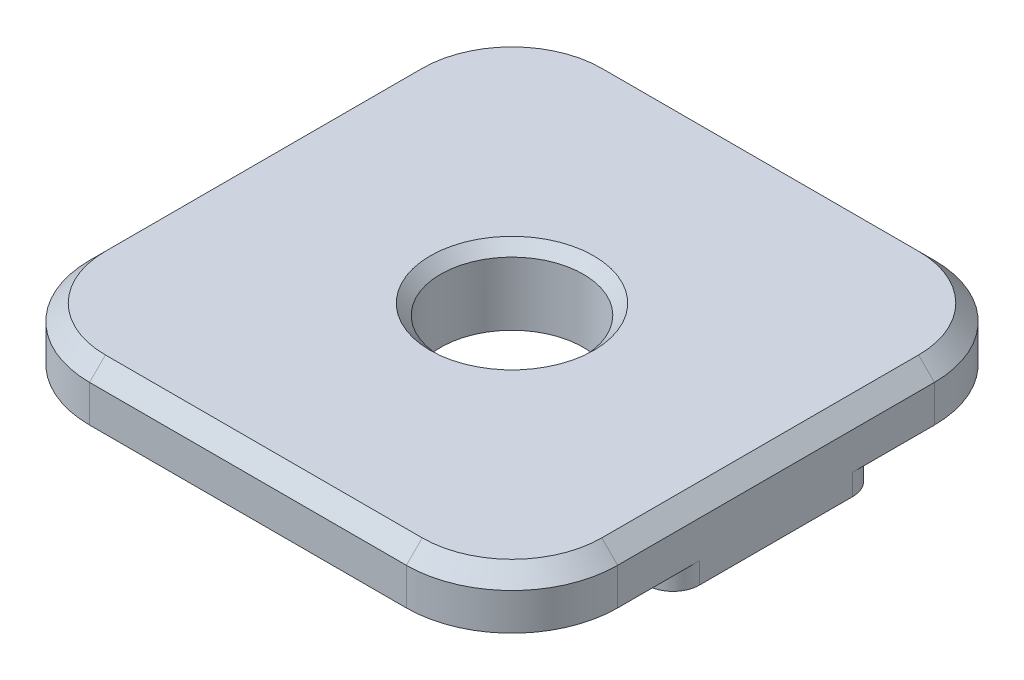
ISO-10303-21;
HEADER;
FILE_DESCRIPTION(('STEP AP214'),'2;1');
FILE_NAME('part.step','',(''),(''),'','','');
FILE_SCHEMA(('AUTOMOTIVE_DESIGN { 1 0 10303 214 1 1 1 1 }'));
ENDSEC;
DATA;
#1=APPLICATION_CONTEXT('core data for automotive mechanical design processes');
#2=APPLICATION_PROTOCOL_DEFINITION('international standard','automotive_design',2000,#1);
#3=PRODUCT_CONTEXT('',#1,'mechanical');
#4=PRODUCT('Part','Part','',(#3));
#5=PRODUCT_RELATED_PRODUCT_CATEGORY('part','',(#4));
#6=PRODUCT_DEFINITION_FORMATION('','',#4);
#7=PRODUCT_DEFINITION_CONTEXT('part definition',#1,'design');
#8=PRODUCT_DEFINITION('design','',#6,#7);
#9=PRODUCT_DEFINITION_SHAPE('','',#8);
#10=(LENGTH_UNIT() NAMED_UNIT(*) SI_UNIT(.MILLI.,.METRE.));
#11=(NAMED_UNIT(*) PLANE_ANGLE_UNIT() SI_UNIT($,.RADIAN.));
#12=(NAMED_UNIT(*) SI_UNIT($,.STERADIAN.) SOLID_ANGLE_UNIT());
#13=UNCERTAINTY_MEASURE_WITH_UNIT(LENGTH_MEASURE(1.E-05),#10,'distance_accuracy_value','');
#14=(GEOMETRIC_REPRESENTATION_CONTEXT(3) GLOBAL_UNCERTAINTY_ASSIGNED_CONTEXT((#13)) GLOBAL_UNIT_ASSIGNED_CONTEXT((#10,
#11,#12)) REPRESENTATION_CONTEXT('',''));
#15=CARTESIAN_POINT('',(0.,0.,0.));
#16=DIRECTION('',(0.,0.,1.));
#17=DIRECTION('',(1.,0.,0.));
#18=AXIS2_PLACEMENT_3D('',#15,#16,#17);
#19=CARTESIAN_POINT('',(-141.999999999975,24.9999599456627,478.900000000001));
#20=DIRECTION('',(0.,0.,1.));
#21=DIRECTION('',(1.,0.,0.));
#22=AXIS2_PLACEMENT_3D('',#19,#20,#21);
#23=PLANE('',#22);
#24=DIRECTION('',(0.,-1.,0.));
#25=VECTOR('',#24,1.);
#26=CARTESIAN_POINT('',(-160.999999999975,24.9999599456629,478.900000000001));
#27=LINE('',#26,#25);
#28=CARTESIAN_POINT('',(-160.999999999975,24.1999599456627,478.900000000001));
#29=VERTEX_POINT('',#28);
#30=CARTESIAN_POINT('',(-160.999999999975,24.9999599456627,478.900000000001));
#31=VERTEX_POINT('',#30);
#32=EDGE_CURVE('E132',#29,#31,#27,.F.);
#33=ORIENTED_EDGE('',*,*,#32,.F.);
#34=DIRECTION('',(1.,0.,0.));
#35=VECTOR('',#34,1.);
#36=CARTESIAN_POINT('',(-151.999999999975,24.1999599456627,478.900000000001));
#37=LINE('',#36,#35);
#38=CARTESIAN_POINT('',(-142.999999999975,24.1999599456627,478.900000000001));
#39=VERTEX_POINT('',#38);
#40=EDGE_CURVE('E219',#39,#29,#37,.F.);
#41=ORIENTED_EDGE('',*,*,#40,.F.);
#42=DIRECTION('',(0.,-1.,0.));
#43=VECTOR('',#42,1.);
#44=CARTESIAN_POINT('',(-142.999999999975,24.9999599456626,478.900000000001));
#45=LINE('',#44,#43);
#46=CARTESIAN_POINT('',(-142.999999999975,24.9999599456627,478.900000000001));
#47=VERTEX_POINT('',#46);
#48=EDGE_CURVE('E146',#47,#39,#45,.T.);
#49=ORIENTED_EDGE('',*,*,#48,.F.);
#50=DIRECTION('',(1.,0.,0.));
#51=VECTOR('',#50,1.);
#52=CARTESIAN_POINT('',(-5.82645044580608E-12,24.9999599456627,478.900000000001));
#53=LINE('',#52,#51);
#54=EDGE_CURVE('E145',#47,#31,#53,.F.);
#55=ORIENTED_EDGE('',*,*,#54,.T.);
#56=EDGE_LOOP('',(#33,#41,#49,#55));
#57=FACE_BOUND('',#56,.T.);
#58=ADVANCED_FACE('F17',(#57),#23,.T.);
#59=CARTESIAN_POINT('',(-161.999999999975,24.9999599456629,471.100000000001));
#60=DIRECTION('',(0.,0.,-1.));
#61=DIRECTION('',(-1.,0.,0.));
#62=AXIS2_PLACEMENT_3D('',#59,#60,#61);
#63=PLANE('',#62);
#64=DIRECTION('',(0.,-1.,0.));
#65=VECTOR('',#64,1.);
#66=CARTESIAN_POINT('',(-160.999999999975,24.999959945663,471.100000000001));
#67=LINE('',#66,#65);
#68=CARTESIAN_POINT('',(-160.999999999975,24.9999599456629,471.100000000001));
#69=VERTEX_POINT('',#68);
#70=CARTESIAN_POINT('',(-160.999999999975,24.1999599456629,471.100000000001));
#71=VERTEX_POINT('',#70);
#72=EDGE_CURVE('E142',#69,#71,#67,.T.);
#73=ORIENTED_EDGE('',*,*,#72,.F.);
#74=DIRECTION('',(1.,0.,0.));
#75=VECTOR('',#74,1.);
#76=CARTESIAN_POINT('',(-5.82645044580608E-12,24.9999599456629,471.100000000001));
#77=LINE('',#76,#75);
#78=CARTESIAN_POINT('',(-142.999999999975,24.9999599456629,471.100000000001));
#79=VERTEX_POINT('',#78);
#80=EDGE_CURVE('E225',#69,#79,#77,.T.);
#81=ORIENTED_EDGE('',*,*,#80,.T.);
#82=DIRECTION('',(0.,-1.,0.));
#83=VECTOR('',#82,1.);
#84=CARTESIAN_POINT('',(-142.999999999975,24.9999599456627,471.100000000001));
#85=LINE('',#84,#83);
#86=CARTESIAN_POINT('',(-142.999999999975,24.1999599456629,471.100000000001));
#87=VERTEX_POINT('',#86);
#88=EDGE_CURVE('E177',#87,#79,#85,.F.);
#89=ORIENTED_EDGE('',*,*,#88,.F.);
#90=DIRECTION('',(1.,0.,0.));
#91=VECTOR('',#90,1.);
#92=CARTESIAN_POINT('',(-151.999999999975,24.1999599456629,471.100000000001));
#93=LINE('',#92,#91);
#94=EDGE_CURVE('E217',#71,#87,#93,.T.);
#95=ORIENTED_EDGE('',*,*,#94,.F.);
#96=EDGE_LOOP('',(#73,#81,#89,#95));
#97=FACE_BOUND('',#96,.T.);
#98=ADVANCED_FACE('F644',(#97),#63,.T.);
#99=CARTESIAN_POINT('',(-160.999999999975,24.999959945663,472.100000000001));
#100=DIRECTION('',(0.,-1.,0.));
#101=DIRECTION('',(1.,0.,0.));
#102=AXIS2_PLACEMENT_3D('',#99,#100,#101);
#103=CYLINDRICAL_SURFACE('',#102,1.);
#104=CARTESIAN_POINT('',(-160.999999999975,24.9999599456629,472.100000000001));
#105=DIRECTION('',(0.,-1.,0.));
#106=DIRECTION('',(1.,0.,0.));
#107=AXIS2_PLACEMENT_3D('',#104,#105,#106);
#108=CIRCLE('',#107,1.);
#109=CARTESIAN_POINT('',(-161.999999999975,24.999959945663,472.100000000001));
#110=VERTEX_POINT('',#109);
#111=EDGE_CURVE('E226',#110,#69,#108,.T.);
#112=ORIENTED_EDGE('',*,*,#111,.T.);
#113=ORIENTED_EDGE('',*,*,#72,.T.);
#114=CARTESIAN_POINT('',(-160.999999999975,24.1999599456629,472.100000000001));
#115=DIRECTION('',(0.,-1.,0.));
#116=DIRECTION('',(1.,0.,0.));
#117=AXIS2_PLACEMENT_3D('',#114,#115,#116);
#118=CIRCLE('',#117,1.);
#119=CARTESIAN_POINT('',(-161.999999999975,24.1999599456629,472.100000000001));
#120=VERTEX_POINT('',#119);
#121=EDGE_CURVE('E214',#120,#71,#118,.T.);
#122=ORIENTED_EDGE('',*,*,#121,.F.);
#123=DIRECTION('',(0.,1.,0.));
#124=VECTOR('',#123,1.);
#125=CARTESIAN_POINT('',(-161.999999999975,24.9999599456631,472.100000000001));
#126=LINE('',#125,#124);
#127=EDGE_CURVE('E169',#110,#120,#126,.F.);
#128=ORIENTED_EDGE('',*,*,#127,.F.);
#129=EDGE_LOOP('',(#112,#113,#122,#128));
#130=FACE_BOUND('',#129,.T.);
#131=ADVANCED_FACE('F636',(#130),#103,.T.);
#132=CARTESIAN_POINT('',(-160.999999999975,24.9999599456629,477.900000000001));
#133=DIRECTION('',(0.,-1.,0.));
#134=DIRECTION('',(1.,0.,0.));
#135=AXIS2_PLACEMENT_3D('',#132,#133,#134);
#136=CYLINDRICAL_SURFACE('',#135,1.);
#137=CARTESIAN_POINT('',(-160.999999999975,24.9999599456627,477.900000000001));
#138=DIRECTION('',(0.,-1.,0.));
#139=DIRECTION('',(1.,0.,0.));
#140=AXIS2_PLACEMENT_3D('',#137,#138,#139);
#141=CIRCLE('',#140,1.);
#142=CARTESIAN_POINT('',(-161.999999999975,24.9999599456627,477.900000000001));
#143=VERTEX_POINT('',#142);
#144=EDGE_CURVE('E20',#31,#143,#141,.T.);
#145=ORIENTED_EDGE('',*,*,#144,.T.);
#146=DIRECTION('',(0.,1.,0.));
#147=VECTOR('',#146,1.);
#148=CARTESIAN_POINT('',(-161.999999999975,24.9999599456631,477.900000000001));
#149=LINE('',#148,#147);
#150=CARTESIAN_POINT('',(-161.999999999975,24.1999599456628,477.900000000001));
#151=VERTEX_POINT('',#150);
#152=EDGE_CURVE('E161',#151,#143,#149,.T.);
#153=ORIENTED_EDGE('',*,*,#152,.F.);
#154=CARTESIAN_POINT('',(-160.999999999975,24.1999599456627,477.900000000001));
#155=DIRECTION('',(0.,-1.,0.));
#156=DIRECTION('',(1.,0.,0.));
#157=AXIS2_PLACEMENT_3D('',#154,#155,#156);
#158=CIRCLE('',#157,1.);
#159=EDGE_CURVE('E138',#29,#151,#158,.T.);
#160=ORIENTED_EDGE('',*,*,#159,.F.);
#161=ORIENTED_EDGE('',*,*,#32,.T.);
#162=EDGE_LOOP('',(#145,#153,#160,#161));
#163=FACE_BOUND('',#162,.T.);
#164=ADVANCED_FACE('F134',(#163),#136,.T.);
#165=CARTESIAN_POINT('',(-5.82645044580608E-12,24.9999599456628,475.000000476843));
#166=DIRECTION('',(0.,1.,0.));
#167=DIRECTION('',(0.,0.,1.));
#168=AXIS2_PLACEMENT_3D('',#165,#166,#167);
#169=PLANE('',#168);
#170=CARTESIAN_POINT('',(-142.999999999975,24.9999599456627,477.900000000001));
#171=DIRECTION('',(0.,-1.,0.));
#172=DIRECTION('',(1.,0.,0.));
#173=AXIS2_PLACEMENT_3D('',#170,#171,#172);
#174=CIRCLE('',#173,1.);
#175=CARTESIAN_POINT('',(-141.999999999975,24.9999599456626,477.900000000001));
#176=VERTEX_POINT('',#175);
#177=EDGE_CURVE('E149',#176,#47,#174,.T.);
#178=ORIENTED_EDGE('',*,*,#177,.F.);
#179=DIRECTION('',(0.,0.,-1.));
#180=VECTOR('',#179,1.);
#181=CARTESIAN_POINT('',(-141.999999999975,24.9999599456626,485.000000000001));
#182=LINE('',#181,#180);
#183=CARTESIAN_POINT('',(-141.999999999975,24.9999599456626,481.000000000001));
#184=VERTEX_POINT('',#183);
#185=EDGE_CURVE('E237',#184,#176,#182,.T.);
#186=ORIENTED_EDGE('',*,*,#185,.F.);
#187=CARTESIAN_POINT('',(-145.999999999975,24.9999599456626,481.000000000001));
#188=DIRECTION('',(0.,1.,0.));
#189=DIRECTION('',(0.,0.,1.));
#190=AXIS2_PLACEMENT_3D('',#187,#188,#189);
#191=CIRCLE('',#190,4.);
#192=CARTESIAN_POINT('',(-145.999999999975,24.9999599456625,485.000000000001));
#193=VERTEX_POINT('',#192);
#194=EDGE_CURVE('E208',#193,#184,#191,.T.);
#195=ORIENTED_EDGE('',*,*,#194,.F.);
#196=DIRECTION('',(1.,0.,0.));
#197=VECTOR('',#196,1.);
#198=CARTESIAN_POINT('',(-161.999999999975,24.9999599456625,485.000000000001));
#199=LINE('',#198,#197);
#200=CARTESIAN_POINT('',(-157.999999999975,24.9999599456625,485.000000000001));
#201=VERTEX_POINT('',#200);
#202=EDGE_CURVE('E267',#201,#193,#199,.T.);
#203=ORIENTED_EDGE('',*,*,#202,.F.);
#204=CARTESIAN_POINT('',(-157.999999999975,24.9999599456626,481.000000000001));
#205=DIRECTION('',(0.,1.,0.));
#206=DIRECTION('',(0.,0.,1.));
#207=AXIS2_PLACEMENT_3D('',#204,#205,#206);
#208=CIRCLE('',#207,4.);
#209=CARTESIAN_POINT('',(-161.999999999975,24.9999599456626,481.000000000001));
#210=VERTEX_POINT('',#209);
#211=EDGE_CURVE('E156',#210,#201,#208,.T.);
#212=ORIENTED_EDGE('',*,*,#211,.F.);
#213=DIRECTION('',(0.,0.,1.));
#214=VECTOR('',#213,1.);
#215=CARTESIAN_POINT('',(-161.999999999975,24.9999599456627,465.000000000001));
#216=LINE('',#215,#214);
#217=EDGE_CURVE('E153',#143,#210,#216,.T.);
#218=ORIENTED_EDGE('',*,*,#217,.F.);
#219=ORIENTED_EDGE('',*,*,#144,.F.);
#220=ORIENTED_EDGE('',*,*,#54,.F.);
#221=EDGE_LOOP('',(#178,#186,#195,#203,#212,#218,#219,#220));
#222=FACE_BOUND('',#221,.T.);
#223=ADVANCED_FACE('F151',(#222),#169,.F.);
#224=CARTESIAN_POINT('',(-142.999999999975,24.9999599456626,477.900000000001));
#225=DIRECTION('',(0.,-1.,0.));
#226=DIRECTION('',(1.,0.,0.));
#227=AXIS2_PLACEMENT_3D('',#224,#225,#226);
#228=CYLINDRICAL_SURFACE('',#227,1.);
#229=ORIENTED_EDGE('',*,*,#177,.T.);
#230=ORIENTED_EDGE('',*,*,#48,.T.);
#231=CARTESIAN_POINT('',(-142.999999999975,24.1999599456627,477.900000000001));
#232=DIRECTION('',(0.,-1.,0.));
#233=DIRECTION('',(1.,0.,0.));
#234=AXIS2_PLACEMENT_3D('',#231,#232,#233);
#235=CIRCLE('',#234,1.);
#236=CARTESIAN_POINT('',(-141.999999999975,24.1999599456627,477.900000000001));
#237=VERTEX_POINT('',#236);
#238=EDGE_CURVE('E220',#237,#39,#235,.T.);
#239=ORIENTED_EDGE('',*,*,#238,.F.);
#240=DIRECTION('',(0.,1.,0.));
#241=VECTOR('',#240,1.);
#242=CARTESIAN_POINT('',(-141.999999999975,24.9999599456625,477.900000000001));
#243=LINE('',#242,#241);
#244=EDGE_CURVE('E233',#176,#237,#243,.F.);
#245=ORIENTED_EDGE('',*,*,#244,.F.);
#246=EDGE_LOOP('',(#229,#230,#239,#245));
#247=FACE_BOUND('',#246,.T.);
#248=ADVANCED_FACE('F231',(#247),#228,.T.);
#249=CARTESIAN_POINT('',(-142.999999999975,24.9999599456627,472.100000000001));
#250=DIRECTION('',(0.,-1.,0.));
#251=DIRECTION('',(1.,0.,0.));
#252=AXIS2_PLACEMENT_3D('',#249,#250,#251);
#253=CYLINDRICAL_SURFACE('',#252,1.);
#254=CARTESIAN_POINT('',(-142.999999999975,24.9999599456629,472.100000000001));
#255=DIRECTION('',(0.,-1.,0.));
#256=DIRECTION('',(1.,0.,0.));
#257=AXIS2_PLACEMENT_3D('',#254,#255,#256);
#258=CIRCLE('',#257,1.);
#259=CARTESIAN_POINT('',(-141.999999999975,24.9999599456629,472.100000000001));
#260=VERTEX_POINT('',#259);
#261=EDGE_CURVE('E178',#79,#260,#258,.T.);
#262=ORIENTED_EDGE('',*,*,#261,.T.);
#263=DIRECTION('',(0.,1.,0.));
#264=VECTOR('',#263,1.);
#265=CARTESIAN_POINT('',(-141.999999999975,24.9999599456625,472.100000000001));
#266=LINE('',#265,#264);
#267=CARTESIAN_POINT('',(-141.999999999975,24.1999599456628,472.100000000001));
#268=VERTEX_POINT('',#267);
#269=EDGE_CURVE('E300',#268,#260,#266,.T.);
#270=ORIENTED_EDGE('',*,*,#269,.F.);
#271=CARTESIAN_POINT('',(-142.999999999975,24.1999599456629,472.100000000001));
#272=DIRECTION('',(0.,-1.,0.));
#273=DIRECTION('',(1.,0.,0.));
#274=AXIS2_PLACEMENT_3D('',#271,#272,#273);
#275=CIRCLE('',#274,1.);
#276=EDGE_CURVE('E223',#87,#268,#275,.T.);
#277=ORIENTED_EDGE('',*,*,#276,.F.);
#278=ORIENTED_EDGE('',*,*,#88,.T.);
#279=EDGE_LOOP('',(#262,#270,#277,#278));
#280=FACE_BOUND('',#279,.T.);
#281=ADVANCED_FACE('F605',(#280),#253,.T.);
#282=CARTESIAN_POINT('',(-5.82645044580608E-12,24.9999599456628,475.000000476843));
#283=DIRECTION('',(0.,1.,0.));
#284=DIRECTION('',(0.,0.,1.));
#285=AXIS2_PLACEMENT_3D('',#282,#283,#284);
#286=PLANE('',#285);
#287=ORIENTED_EDGE('',*,*,#111,.F.);
#288=DIRECTION('',(0.,0.,1.));
#289=VECTOR('',#288,1.);
#290=CARTESIAN_POINT('',(-161.999999999975,24.999959945663,465.000000000001));
#291=LINE('',#290,#289);
#292=CARTESIAN_POINT('',(-161.999999999975,24.999959945663,469.000000000001));
#293=VERTEX_POINT('',#292);
#294=EDGE_CURVE('E174',#293,#110,#291,.T.);
#295=ORIENTED_EDGE('',*,*,#294,.F.);
#296=CARTESIAN_POINT('',(-157.999999999975,24.999959945663,469.000000000001));
#297=DIRECTION('',(0.,1.,0.));
#298=DIRECTION('',(0.,0.,1.));
#299=AXIS2_PLACEMENT_3D('',#296,#297,#298);
#300=CIRCLE('',#299,4.);
#301=CARTESIAN_POINT('',(-157.999999999975,24.9999599456631,465.000000000001));
#302=VERTEX_POINT('',#301);
#303=EDGE_CURVE('E200',#302,#293,#300,.T.);
#304=ORIENTED_EDGE('',*,*,#303,.F.);
#305=DIRECTION('',(1.,0.,0.));
#306=VECTOR('',#305,1.);
#307=CARTESIAN_POINT('',(-141.999999999975,24.9999599456631,465.000000000001));
#308=LINE('',#307,#306);
#309=CARTESIAN_POINT('',(-145.999999999975,24.9999599456631,465.000000000001));
#310=VERTEX_POINT('',#309);
#311=EDGE_CURVE('E296',#310,#302,#308,.F.);
#312=ORIENTED_EDGE('',*,*,#311,.F.);
#313=CARTESIAN_POINT('',(-145.999999999975,24.999959945663,469.000000000001));
#314=DIRECTION('',(0.,1.,0.));
#315=DIRECTION('',(0.,0.,1.));
#316=AXIS2_PLACEMENT_3D('',#313,#314,#315);
#317=CIRCLE('',#316,4.);
#318=CARTESIAN_POINT('',(-141.999999999975,24.999959945663,469.000000000001));
#319=VERTEX_POINT('',#318);
#320=EDGE_CURVE('E204',#319,#310,#317,.T.);
#321=ORIENTED_EDGE('',*,*,#320,.F.);
#322=DIRECTION('',(0.,0.,-1.));
#323=VECTOR('',#322,1.);
#324=CARTESIAN_POINT('',(-141.999999999975,24.9999599456629,485.000000000001));
#325=LINE('',#324,#323);
#326=EDGE_CURVE('E298',#260,#319,#325,.T.);
#327=ORIENTED_EDGE('',*,*,#326,.F.);
#328=ORIENTED_EDGE('',*,*,#261,.F.);
#329=ORIENTED_EDGE('',*,*,#80,.F.);
#330=EDGE_LOOP('',(#287,#295,#304,#312,#321,#327,#328,#329));
#331=FACE_BOUND('',#330,.T.);
#332=ADVANCED_FACE('F596',(#331),#286,.F.);
#333=CARTESIAN_POINT('',(-151.999999999975,24.1999599456628,475.000000000001));
#334=DIRECTION('',(0.,-1.,0.));
#335=DIRECTION('',(0.,0.,-1.));
#336=AXIS2_PLACEMENT_3D('',#333,#334,#335);
#337=PLANE('',#336);
#338=CARTESIAN_POINT('',(-151.999999999975,24.1999599456628,475.000000000001));
#339=DIRECTION('',(0.,1.,0.));
#340=DIRECTION('',(0.,0.,1.));
#341=AXIS2_PLACEMENT_3D('',#338,#339,#340);
#342=CIRCLE('',#341,2.7);
#343=CARTESIAN_POINT('',(-151.999999999975,24.1999599456627,477.700000000001));
#344=VERTEX_POINT('',#343);
#345=EDGE_CURVE('E195',#344,#344,#342,.T.);
#346=ORIENTED_EDGE('',*,*,#345,.T.);
#347=EDGE_LOOP('',(#346));
#348=FACE_BOUND('',#347,.T.);
#349=ORIENTED_EDGE('',*,*,#121,.T.);
#350=ORIENTED_EDGE('',*,*,#94,.T.);
#351=ORIENTED_EDGE('',*,*,#276,.T.);
#352=DIRECTION('',(0.,0.,-1.));
#353=VECTOR('',#352,1.);
#354=CARTESIAN_POINT('',(-141.999999999975,24.1999599456627,485.000000000001));
#355=LINE('',#354,#353);
#356=EDGE_CURVE('E303',#237,#268,#355,.T.);
#357=ORIENTED_EDGE('',*,*,#356,.F.);
#358=ORIENTED_EDGE('',*,*,#238,.T.);
#359=ORIENTED_EDGE('',*,*,#40,.T.);
#360=ORIENTED_EDGE('',*,*,#159,.T.);
#361=DIRECTION('',(0.,0.,1.));
#362=VECTOR('',#361,1.);
#363=CARTESIAN_POINT('',(-161.999999999975,24.1999599456629,465.000000000001));
#364=LINE('',#363,#362);
#365=EDGE_CURVE('E167',#120,#151,#364,.T.);
#366=ORIENTED_EDGE('',*,*,#365,.F.);
#367=EDGE_LOOP('',(#349,#350,#351,#357,#358,#359,#360,#366));
#368=FACE_BOUND('',#367,.T.);
#369=ADVANCED_FACE('F588',(#348,#368),#337,.T.);
#370=CARTESIAN_POINT('',(-161.999999999975,24.9999599456631,465.000000000001));
#371=DIRECTION('',(-1.,0.,0.));
#372=DIRECTION('',(0.,0.,1.));
#373=AXIS2_PLACEMENT_3D('',#370,#371,#372);
#374=PLANE('',#373);
#375=ORIENTED_EDGE('',*,*,#217,.T.);
#376=DIRECTION('',(0.,1.,0.));
#377=VECTOR('',#376,1.);
#378=CARTESIAN_POINT('',(-161.999999999975,24.9999599456626,481.000000000001));
#379=LINE('',#378,#377);
#380=CARTESIAN_POINT('',(-162.000000000004,26.399959945653,480.999999999988));
#381=VERTEX_POINT('',#380);
#382=EDGE_CURVE('E160',#381,#210,#379,.F.);
#383=ORIENTED_EDGE('',*,*,#382,.F.);
#384=DIRECTION('',(0.,0.,1.));
#385=VECTOR('',#384,1.);
#386=CARTESIAN_POINT('',(-161.999999999975,26.399959945663,470.000000238422));
#387=LINE('',#386,#385);
#388=CARTESIAN_POINT('',(-161.999999999915,26.3999599457274,469.00000000001));
#389=VERTEX_POINT('',#388);
#390=EDGE_CURVE('E198',#389,#381,#387,.T.);
#391=ORIENTED_EDGE('',*,*,#390,.F.);
#392=DIRECTION('',(0.,1.,0.));
#393=VECTOR('',#392,1.);
#394=CARTESIAN_POINT('',(-161.999999999975,24.999959945663,469.000000000001));
#395=LINE('',#394,#393);
#396=EDGE_CURVE('E199',#293,#389,#395,.T.);
#397=ORIENTED_EDGE('',*,*,#396,.F.);
#398=ORIENTED_EDGE('',*,*,#294,.T.);
#399=ORIENTED_EDGE('',*,*,#127,.T.);
#400=ORIENTED_EDGE('',*,*,#365,.T.);
#401=ORIENTED_EDGE('',*,*,#152,.T.);
#402=EDGE_LOOP('',(#375,#383,#391,#397,#398,#399,#400,#401));
#403=FACE_BOUND('',#402,.T.);
#404=ADVANCED_FACE('F164',(#403),#374,.T.);
#405=CARTESIAN_POINT('',(-157.999999999975,24.9999599456626,481.000000000001));
#406=DIRECTION('',(0.,1.,0.));
#407=DIRECTION('',(0.,0.,1.));
#408=AXIS2_PLACEMENT_3D('',#405,#406,#407);
#409=CYLINDRICAL_SURFACE('',#408,4.);
#410=ORIENTED_EDGE('',*,*,#211,.T.);
#411=DIRECTION('',(0.,-1.,0.));
#412=VECTOR('',#411,1.);
#413=CARTESIAN_POINT('',(-157.999999999975,24.9999599456625,485.000000000001));
#414=LINE('',#413,#412);
#415=CARTESIAN_POINT('',(-157.999999999983,26.3999599456592,485.000000000015));
#416=VERTEX_POINT('',#415);
#417=EDGE_CURVE('E213',#416,#201,#414,.T.);
#418=ORIENTED_EDGE('',*,*,#417,.F.);
#419=CARTESIAN_POINT('',(-157.999999999975,26.3999599456497,481.000000000001));
#420=DIRECTION('',(0.,-1.,0.));
#421=DIRECTION('',(-0.707106781192418,0.,0.707106781180677));
#422=AXIS2_PLACEMENT_3D('',#419,#420,#421);
#423=CIRCLE('',#422,4.00000000005557);
#424=EDGE_CURVE('E280',#381,#416,#423,.F.);
#425=ORIENTED_EDGE('',*,*,#424,.F.);
#426=ORIENTED_EDGE('',*,*,#382,.T.);
#427=EDGE_LOOP('',(#410,#418,#425,#426));
#428=FACE_BOUND('',#427,.T.);
#429=ADVANCED_FACE('F316',(#428),#409,.T.);
#430=CARTESIAN_POINT('',(-161.999999999975,24.9999599456625,485.000000000001));
#431=DIRECTION('',(0.,0.,1.));
#432=DIRECTION('',(0.,-1.,0.));
#433=AXIS2_PLACEMENT_3D('',#430,#431,#432);
#434=PLANE('',#433);
#435=ORIENTED_EDGE('',*,*,#202,.T.);
#436=DIRECTION('',(0.,1.,0.));
#437=VECTOR('',#436,1.);
#438=CARTESIAN_POINT('',(-145.999999999975,24.9999599456626,485.000000000001));
#439=LINE('',#438,#437);
#440=CARTESIAN_POINT('',(-145.999999999974,26.3999599456955,485.000000000014));
#441=VERTEX_POINT('',#440);
#442=EDGE_CURVE('E211',#441,#193,#439,.F.);
#443=ORIENTED_EDGE('',*,*,#442,.F.);
#444=DIRECTION('',(1.,0.,0.));
#445=VECTOR('',#444,1.);
#446=CARTESIAN_POINT('',(-80.9999999999906,26.3999599456624,485.000000000001));
#447=LINE('',#446,#445);
#448=EDGE_CURVE('E270',#416,#441,#447,.T.);
#449=ORIENTED_EDGE('',*,*,#448,.F.);
#450=ORIENTED_EDGE('',*,*,#417,.T.);
#451=EDGE_LOOP('',(#435,#443,#449,#450));
#452=FACE_BOUND('',#451,.T.);
#453=ADVANCED_FACE('F308',(#452),#434,.T.);
#454=CARTESIAN_POINT('',(-145.999999999975,24.9999599456627,481.000000000001));
#455=DIRECTION('',(0.,1.,0.));
#456=DIRECTION('',(0.,0.,1.));
#457=AXIS2_PLACEMENT_3D('',#454,#455,#456);
#458=CYLINDRICAL_SURFACE('',#457,4.);
#459=ORIENTED_EDGE('',*,*,#194,.T.);
#460=DIRECTION('',(0.,1.,0.));
#461=VECTOR('',#460,1.);
#462=CARTESIAN_POINT('',(-141.999999999975,24.9999599456625,481.000000000001));
#463=LINE('',#462,#461);
#464=CARTESIAN_POINT('',(-141.999999999965,26.3999599456735,480.999999999996));
#465=VERTEX_POINT('',#464);
#466=EDGE_CURVE('E210',#465,#184,#463,.F.);
#467=ORIENTED_EDGE('',*,*,#466,.F.);
#468=CARTESIAN_POINT('',(-145.999999999975,26.3999599457065,481.000000000001));
#469=DIRECTION('',(0.,-1.,0.));
#470=DIRECTION('',(0.707106781189462,0.,0.707106781183633));
#471=AXIS2_PLACEMENT_3D('',#468,#469,#470);
#472=CIRCLE('',#471,4.00000000003884);
#473=EDGE_CURVE('E260',#441,#465,#472,.F.);
#474=ORIENTED_EDGE('',*,*,#473,.F.);
#475=ORIENTED_EDGE('',*,*,#442,.T.);
#476=EDGE_LOOP('',(#459,#467,#474,#475));
#477=FACE_BOUND('',#476,.T.);
#478=ADVANCED_FACE('F559',(#477),#458,.T.);
#479=CARTESIAN_POINT('',(-141.999999999975,24.9999599456625,485.000000000001));
#480=DIRECTION('',(1.,0.,0.));
#481=DIRECTION('',(0.,0.,-1.));
#482=AXIS2_PLACEMENT_3D('',#479,#480,#481);
#483=PLANE('',#482);
#484=ORIENTED_EDGE('',*,*,#326,.T.);
#485=DIRECTION('',(0.,1.,0.));
#486=VECTOR('',#485,1.);
#487=CARTESIAN_POINT('',(-141.999999999975,24.999959945663,469.000000000001));
#488=LINE('',#487,#486);
#489=CARTESIAN_POINT('',(-141.99999999996,26.3999599456956,469.));
#490=VERTEX_POINT('',#489);
#491=EDGE_CURVE('E207',#490,#319,#488,.F.);
#492=ORIENTED_EDGE('',*,*,#491,.F.);
#493=DIRECTION('',(0.,0.,1.));
#494=VECTOR('',#493,1.);
#495=CARTESIAN_POINT('',(-141.999999999975,26.3999599456625,480.000000238422));
#496=LINE('',#495,#494);
#497=EDGE_CURVE('E248',#465,#490,#496,.F.);
#498=ORIENTED_EDGE('',*,*,#497,.F.);
#499=ORIENTED_EDGE('',*,*,#466,.T.);
#500=ORIENTED_EDGE('',*,*,#185,.T.);
#501=ORIENTED_EDGE('',*,*,#244,.T.);
#502=ORIENTED_EDGE('',*,*,#356,.T.);
#503=ORIENTED_EDGE('',*,*,#269,.T.);
#504=EDGE_LOOP('',(#484,#492,#498,#499,#500,#501,#502,#503));
#505=FACE_BOUND('',#504,.T.);
#506=ADVANCED_FACE('F244',(#505),#483,.T.);
#507=CARTESIAN_POINT('',(-145.999999999975,24.999959945663,469.000000000001));
#508=DIRECTION('',(0.,1.,0.));
#509=DIRECTION('',(0.,0.,1.));
#510=AXIS2_PLACEMENT_3D('',#507,#508,#509);
#511=CYLINDRICAL_SURFACE('',#510,4.);
#512=ORIENTED_EDGE('',*,*,#320,.T.);
#513=DIRECTION('',(0.,1.,0.));
#514=VECTOR('',#513,1.);
#515=CARTESIAN_POINT('',(-145.999999999975,24.9999599456631,465.000000000001));
#516=LINE('',#515,#514);
#517=CARTESIAN_POINT('',(-145.999999999977,26.399959945674,465.000000000009));
#518=VERTEX_POINT('',#517);
#519=EDGE_CURVE('E206',#518,#310,#516,.F.);
#520=ORIENTED_EDGE('',*,*,#519,.F.);
#521=CARTESIAN_POINT('',(-145.999999999975,26.3999599457065,469.000000000001));
#522=DIRECTION('',(0.,-1.,0.));
#523=DIRECTION('',(0.707106781187783,0.,-0.707106781185312));
#524=AXIS2_PLACEMENT_3D('',#521,#522,#523);
#525=CIRCLE('',#524,3.99999999996796);
#526=EDGE_CURVE('E361',#490,#518,#525,.F.);
#527=ORIENTED_EDGE('',*,*,#526,.F.);
#528=ORIENTED_EDGE('',*,*,#491,.T.);
#529=EDGE_LOOP('',(#512,#520,#527,#528));
#530=FACE_BOUND('',#529,.T.);
#531=ADVANCED_FACE('F544',(#530),#511,.T.);
#532=CARTESIAN_POINT('',(-141.999999999975,24.9999599456631,465.000000000001));
#533=DIRECTION('',(0.,0.,-1.));
#534=DIRECTION('',(0.,1.,0.));
#535=AXIS2_PLACEMENT_3D('',#532,#533,#534);
#536=PLANE('',#535);
#537=ORIENTED_EDGE('',*,*,#311,.T.);
#538=DIRECTION('',(0.,1.,0.));
#539=VECTOR('',#538,1.);
#540=CARTESIAN_POINT('',(-157.999999999975,24.9999599456631,465.000000000001));
#541=LINE('',#540,#539);
#542=CARTESIAN_POINT('',(-157.999999999991,26.3999599457596,465.000000000069));
#543=VERTEX_POINT('',#542);
#544=EDGE_CURVE('E203',#543,#302,#541,.F.);
#545=ORIENTED_EDGE('',*,*,#544,.F.);
#546=DIRECTION('',(1.,0.,0.));
#547=VECTOR('',#546,1.);
#548=CARTESIAN_POINT('',(-70.9999999999906,26.3999599456631,465.000000000001));
#549=LINE('',#548,#547);
#550=EDGE_CURVE('E352',#518,#543,#549,.F.);
#551=ORIENTED_EDGE('',*,*,#550,.F.);
#552=ORIENTED_EDGE('',*,*,#519,.T.);
#553=EDGE_LOOP('',(#537,#545,#551,#552));
#554=FACE_BOUND('',#553,.T.);
#555=ADVANCED_FACE('F421',(#554),#536,.T.);
#556=CARTESIAN_POINT('',(-157.999999999975,24.999959945663,469.000000000001));
#557=DIRECTION('',(0.,1.,0.));
#558=DIRECTION('',(0.,0.,1.));
#559=AXIS2_PLACEMENT_3D('',#556,#557,#558);
#560=CYLINDRICAL_SURFACE('',#559,4.);
#561=ORIENTED_EDGE('',*,*,#303,.T.);
#562=ORIENTED_EDGE('',*,*,#396,.T.);
#563=CARTESIAN_POINT('',(-157.999999999975,26.3999599457065,469.000000000001));
#564=DIRECTION('',(0.,-1.,0.));
#565=DIRECTION('',(-0.707106781190739,0.,-0.707106781182356));
#566=AXIS2_PLACEMENT_3D('',#563,#564,#565);
#567=CIRCLE('',#566,3.99999999998468);
#568=EDGE_CURVE('E339',#543,#389,#567,.F.);
#569=ORIENTED_EDGE('',*,*,#568,.F.);
#570=ORIENTED_EDGE('',*,*,#544,.T.);
#571=EDGE_LOOP('',(#561,#562,#569,#570));
#572=FACE_BOUND('',#571,.T.);
#573=ADVANCED_FACE('F426',(#572),#560,.T.);
#574=CARTESIAN_POINT('',(-151.999999999975,24.9999599456628,475.000000000001));
#575=DIRECTION('',(0.,1.,0.));
#576=DIRECTION('',(0.,0.,1.));
#577=AXIS2_PLACEMENT_3D('',#574,#575,#576);
#578=CYLINDRICAL_SURFACE('',#577,2.7);
#579=ORIENTED_EDGE('',*,*,#345,.F.);
#580=EDGE_LOOP('',(#579));
#581=FACE_BOUND('',#580,.T.);
#582=CARTESIAN_POINT('',(-151.999999999975,26.5999599456563,475.000000000001));
#583=DIRECTION('',(0.,1.,0.));
#584=DIRECTION('',(-1.,0.,0.));
#585=AXIS2_PLACEMENT_3D('',#582,#583,#584);
#586=CIRCLE('',#585,2.70000000001619);
#587=CARTESIAN_POINT('',(-154.699999999991,26.5999599456563,475.000000000001));
#588=VERTEX_POINT('',#587);
#589=EDGE_CURVE('E333',#588,#588,#586,.T.);
#590=ORIENTED_EDGE('',*,*,#589,.T.);
#591=EDGE_LOOP('',(#590));
#592=FACE_BOUND('',#591,.T.);
#593=ADVANCED_FACE('F521',(#581,#592),#578,.F.);
#594=CARTESIAN_POINT('',(-161.699999999975,26.699959945663,470.000000238422));
#595=DIRECTION('',(-0.707106781186555,0.70710678118654,0.));
#596=DIRECTION('',(-0.70710678118654,-0.707106781186555,0.));
#597=AXIS2_PLACEMENT_3D('',#594,#595,#596);
#598=PLANE('',#597);
#599=DIRECTION('',(0.707106781186514,0.707106781186581,4.19447809818507E-12));
#600=VECTOR('',#599,1.);
#601=CARTESIAN_POINT('',(-499188.399959898,-499000.,468.999997039845));
#602=LINE('',#601,#600);
#603=CARTESIAN_POINT('',(-161.399999999942,26.999959945712,469.000000000009));
#604=VERTEX_POINT('',#603);
#605=EDGE_CURVE('E335',#389,#604,#602,.T.);
#606=ORIENTED_EDGE('',*,*,#605,.F.);
#607=ORIENTED_EDGE('',*,*,#390,.T.);
#608=DIRECTION('',(0.707106781186462,0.707106781186633,-6.8987038304158E-12));
#609=VECTOR('',#608,1.);
#610=CARTESIAN_POINT('',(-499188.399959825,-499000.,481.000004868596));
#611=LINE('',#610,#609);
#612=CARTESIAN_POINT('',(-161.399999999971,26.9999599456999,480.999999999985));
#613=VERTEX_POINT('',#612);
#614=EDGE_CURVE('E283',#613,#381,#611,.F.);
#615=ORIENTED_EDGE('',*,*,#614,.F.);
#616=DIRECTION('',(0.,0.,1.));
#617=VECTOR('',#616,1.);
#618=CARTESIAN_POINT('',(-161.399999999975,26.9999599456629,475.000000476843));
#619=LINE('',#618,#617);
#620=EDGE_CURVE('E194',#604,#613,#619,.T.);
#621=ORIENTED_EDGE('',*,*,#620,.F.);
#622=EDGE_LOOP('',(#606,#607,#615,#621));
#623=FACE_BOUND('',#622,.T.);
#624=ADVANCED_FACE('F513',(#623),#598,.T.);
#625=CARTESIAN_POINT('',(-157.999999999975,26.3999599456497,481.000000000001));
#626=DIRECTION('',(0.,-1.,0.));
#627=DIRECTION('',(0.,0.,-1.));
#628=AXIS2_PLACEMENT_3D('',#625,#626,#627);
#629=CONICAL_SURFACE('',#628,4.00000000005557,0.785398163398191);
#630=DIRECTION('',(0.,-0.70710678118655,0.707106781186545));
#631=VECTOR('',#630,1.);
#632=CARTESIAN_POINT('',(-157.999999999975,26.6999599456625,484.700000000001));
#633=LINE('',#632,#631);
#634=CARTESIAN_POINT('',(-157.999999999975,26.9999599456839,484.39999999998));
#635=VERTEX_POINT('',#634);
#636=EDGE_CURVE('E273',#635,#416,#633,.T.);
#637=ORIENTED_EDGE('',*,*,#636,.F.);
#638=CARTESIAN_POINT('',(-157.999999999975,26.9999599457052,481.000000000001));
#639=DIRECTION('',(0.,-1.,0.));
#640=DIRECTION('',(0.,0.,-1.));
#641=AXIS2_PLACEMENT_3D('',#638,#639,#640);
#642=CIRCLE('',#641,3.39999999999918);
#643=EDGE_CURVE('E191',#613,#635,#642,.F.);
#644=ORIENTED_EDGE('',*,*,#643,.F.);
#645=ORIENTED_EDGE('',*,*,#614,.T.);
#646=ORIENTED_EDGE('',*,*,#424,.T.);
#647=EDGE_LOOP('',(#637,#644,#645,#646));
#648=FACE_BOUND('',#647,.T.);
#649=ADVANCED_FACE('F319',(#648),#629,.T.);
#650=CARTESIAN_POINT('',(-80.9999999999906,26.6999599456625,484.700000000001));
#651=DIRECTION('',(0.,0.707106781186545,0.70710678118655));
#652=DIRECTION('',(0.,-0.70710678118655,0.707106781186545));
#653=AXIS2_PLACEMENT_3D('',#650,#651,#652);
#654=PLANE('',#653);
#655=ORIENTED_EDGE('',*,*,#636,.T.);
#656=ORIENTED_EDGE('',*,*,#448,.T.);
#657=DIRECTION('',(3.43242101408237E-12,0.707106781186627,-0.707106781186468));
#658=VECTOR('',#657,1.);
#659=CARTESIAN_POINT('',(-146.000002422335,-499000.,499511.399959833));
#660=LINE('',#659,#658);
#661=CARTESIAN_POINT('',(-145.999999999972,26.9999599457199,484.399999999999));
#662=VERTEX_POINT('',#661);
#663=EDGE_CURVE('E263',#662,#441,#660,.F.);
#664=ORIENTED_EDGE('',*,*,#663,.F.);
#665=DIRECTION('',(1.,0.,0.));
#666=VECTOR('',#665,1.);
#667=CARTESIAN_POINT('',(-5.82645044580608E-12,26.9999599456625,484.400000000001));
#668=LINE('',#667,#666);
#669=EDGE_CURVE('E190',#635,#662,#668,.T.);
#670=ORIENTED_EDGE('',*,*,#669,.F.);
#671=EDGE_LOOP('',(#655,#656,#664,#670));
#672=FACE_BOUND('',#671,.T.);
#673=ADVANCED_FACE('F386',(#672),#654,.T.);
#674=CARTESIAN_POINT('',(-145.999999999975,26.3999599457065,481.000000000001));
#675=DIRECTION('',(0.,-1.,0.));
#676=DIRECTION('',(0.,0.,-1.));
#677=AXIS2_PLACEMENT_3D('',#674,#675,#676);
#678=CONICAL_SURFACE('',#677,4.00000000003884,0.785398163398191);
#679=DIRECTION('',(-0.707106781186545,0.70710678118655,0.));
#680=VECTOR('',#679,1.);
#681=CARTESIAN_POINT('',(-142.299999999975,26.6999599456627,481.000000000001));
#682=LINE('',#681,#680);
#683=CARTESIAN_POINT('',(-142.600000000016,26.999959945704,481.000000000001));
#684=VERTEX_POINT('',#683);
#685=EDGE_CURVE('E262',#684,#465,#682,.F.);
#686=ORIENTED_EDGE('',*,*,#685,.F.);
#687=CARTESIAN_POINT('',(-145.999999999975,26.9999599457453,481.000000000001));
#688=DIRECTION('',(0.,-1.,0.));
#689=DIRECTION('',(0.,0.,-1.));
#690=AXIS2_PLACEMENT_3D('',#687,#688,#689);
#691=CIRCLE('',#690,3.39999999999918);
#692=EDGE_CURVE('E187',#662,#684,#691,.F.);
#693=ORIENTED_EDGE('',*,*,#692,.F.);
#694=ORIENTED_EDGE('',*,*,#663,.T.);
#695=ORIENTED_EDGE('',*,*,#473,.T.);
#696=EDGE_LOOP('',(#686,#693,#694,#695));
#697=FACE_BOUND('',#696,.T.);
#698=ADVANCED_FACE('F433',(#697),#678,.T.);
#699=CARTESIAN_POINT('',(-142.299999999975,26.6999599456627,480.000000238422));
#700=DIRECTION('',(0.70710678118655,0.707106781186545,0.));
#701=DIRECTION('',(-0.707106781186545,0.70710678118655,0.));
#702=AXIS2_PLACEMENT_3D('',#699,#700,#701);
#703=PLANE('',#702);
#704=ORIENTED_EDGE('',*,*,#685,.T.);
#705=ORIENTED_EDGE('',*,*,#497,.T.);
#706=DIRECTION('',(-0.707106781186509,0.707106781186586,1.44179113092946E-12));
#707=VECTOR('',#706,1.);
#708=CARTESIAN_POINT('',(498884.399959892,-499000.,468.999998982483));
#709=LINE('',#708,#707);
#710=CARTESIAN_POINT('',(-142.599999999815,26.9999599455827,469.));
#711=VERTEX_POINT('',#710);
#712=EDGE_CURVE('E364',#711,#490,#709,.F.);
#713=ORIENTED_EDGE('',*,*,#712,.F.);
#714=DIRECTION('',(0.,0.,1.));
#715=VECTOR('',#714,1.);
#716=CARTESIAN_POINT('',(-142.599999999975,26.9999599456628,475.000000476843));
#717=LINE('',#716,#715);
#718=EDGE_CURVE('E186',#684,#711,#717,.F.);
#719=ORIENTED_EDGE('',*,*,#718,.F.);
#720=EDGE_LOOP('',(#704,#705,#713,#719));
#721=FACE_BOUND('',#720,.T.);
#722=ADVANCED_FACE('F431',(#721),#703,.T.);
#723=CARTESIAN_POINT('',(-145.999999999975,26.399959945536,469.000000000001));
#724=DIRECTION('',(0.,-1.,0.));
#725=DIRECTION('',(0.,0.,-1.));
#726=AXIS2_PLACEMENT_3D('',#723,#724,#725);
#727=CONICAL_SURFACE('',#726,4.00000000012873,0.785398163417812);
#728=DIRECTION('',(0.,0.707106781186521,0.707106781186574));
#729=VECTOR('',#728,1.);
#730=CARTESIAN_POINT('',(-145.999999999975,26.6999599456631,465.300000000001));
#731=LINE('',#730,#729);
#732=CARTESIAN_POINT('',(-145.999999999975,26.9999599455953,465.599999999933));
#733=VERTEX_POINT('',#732);
#734=EDGE_CURVE('E354',#733,#518,#731,.F.);
#735=ORIENTED_EDGE('',*,*,#734,.F.);
#736=CARTESIAN_POINT('',(-145.999999999975,26.9999599455274,469.000000000001));
#737=DIRECTION('',(0.,-1.,0.));
#738=DIRECTION('',(0.,0.,-1.));
#739=AXIS2_PLACEMENT_3D('',#736,#737,#738);
#740=CIRCLE('',#739,3.40000000011287);
#741=EDGE_CURVE('E183',#711,#733,#740,.F.);
#742=ORIENTED_EDGE('',*,*,#741,.F.);
#743=ORIENTED_EDGE('',*,*,#712,.T.);
#744=ORIENTED_EDGE('',*,*,#526,.T.);
#745=EDGE_LOOP('',(#735,#742,#743,#744));
#746=FACE_BOUND('',#745,.T.);
#747=ADVANCED_FACE('F416',(#746),#727,.T.);
#748=CARTESIAN_POINT('',(-70.9999999999906,26.6999599456631,465.300000000001));
#749=DIRECTION('',(0.,0.707106781186574,-0.707106781186521));
#750=DIRECTION('',(0.,0.707106781186521,0.707106781186574));
#751=AXIS2_PLACEMENT_3D('',#748,#749,#750);
#752=PLANE('',#751);
#753=ORIENTED_EDGE('',*,*,#734,.T.);
#754=ORIENTED_EDGE('',*,*,#550,.T.);
#755=DIRECTION('',(-4.93444174409774E-12,0.707106781186581,0.707106781186514));
#756=VECTOR('',#755,1.);
#757=CARTESIAN_POINT('',(-157.999996517624,-499000.,-498561.399959898));
#758=LINE('',#757,#756);
#759=CARTESIAN_POINT('',(-158.000000000011,26.9999599456552,465.600000000043));
#760=VERTEX_POINT('',#759);
#761=EDGE_CURVE('E35',#760,#543,#758,.F.);
#762=ORIENTED_EDGE('',*,*,#761,.F.);
#763=DIRECTION('',(1.,0.,0.));
#764=VECTOR('',#763,1.);
#765=CARTESIAN_POINT('',(-5.82645044580608E-12,26.9999599456631,465.600000000001));
#766=LINE('',#765,#764);
#767=EDGE_CURVE('E182',#733,#760,#766,.F.);
#768=ORIENTED_EDGE('',*,*,#767,.F.);
#769=EDGE_LOOP('',(#753,#754,#762,#768));
#770=FACE_BOUND('',#769,.T.);
#771=ADVANCED_FACE('F408',(#770),#752,.T.);
#772=CARTESIAN_POINT('',(-157.999999999975,26.3999599458771,469.000000000001));
#773=DIRECTION('',(0.,-1.,0.));
#774=DIRECTION('',(0.,0.,-1.));
#775=AXIS2_PLACEMENT_3D('',#772,#773,#774);
#776=CONICAL_SURFACE('',#775,3.9999999998239,0.785398163398192);
#777=ORIENTED_EDGE('',*,*,#605,.T.);
#778=CARTESIAN_POINT('',(-157.999999999975,26.9999599457009,469.000000000001));
#779=DIRECTION('',(0.,-1.,0.));
#780=DIRECTION('',(0.,0.,-1.));
#781=AXIS2_PLACEMENT_3D('',#778,#779,#780);
#782=CIRCLE('',#781,3.39999999999918);
#783=EDGE_CURVE('E26',#760,#604,#782,.F.);
#784=ORIENTED_EDGE('',*,*,#783,.F.);
#785=ORIENTED_EDGE('',*,*,#761,.T.);
#786=ORIENTED_EDGE('',*,*,#568,.T.);
#787=EDGE_LOOP('',(#777,#784,#785,#786));
#788=FACE_BOUND('',#787,.T.);
#789=ADVANCED_FACE('F429',(#788),#776,.T.);
#790=CARTESIAN_POINT('',(-151.999999999975,26.9999599454991,475.000000000001));
#791=DIRECTION('',(0.,1.,0.));
#792=DIRECTION('',(0.,0.,1.));
#793=AXIS2_PLACEMENT_3D('',#790,#791,#792);
#794=CONICAL_SURFACE('',#793,3.09999999980209,0.785398163326394);
#795=ORIENTED_EDGE('',*,*,#589,.F.);
#796=EDGE_LOOP('',(#795));
#797=FACE_BOUND('',#796,.T.);
#798=CARTESIAN_POINT('',(-151.999999999975,26.9999599456696,475.000000000001));
#799=DIRECTION('',(0.,1.,0.));
#800=DIRECTION('',(0.,0.,1.));
#801=AXIS2_PLACEMENT_3D('',#798,#799,#800);
#802=CIRCLE('',#801,3.09999999997262);
#803=CARTESIAN_POINT('',(-151.999999999975,26.9999599456696,478.099999999974));
#804=VERTEX_POINT('',#803);
#805=EDGE_CURVE('E11',#804,#804,#802,.F.);
#806=ORIENTED_EDGE('',*,*,#805,.F.);
#807=EDGE_LOOP('',(#806));
#808=FACE_BOUND('',#807,.T.);
#809=ADVANCED_FACE('F444',(#797,#808),#794,.F.);
#810=CARTESIAN_POINT('',(-5.82645044580608E-12,26.9999599456628,475.000000476843));
#811=DIRECTION('',(0.,1.,0.));
#812=DIRECTION('',(0.,0.,1.));
#813=AXIS2_PLACEMENT_3D('',#810,#811,#812);
#814=PLANE('',#813);
#815=ORIENTED_EDGE('',*,*,#805,.T.);
#816=EDGE_LOOP('',(#815));
#817=FACE_BOUND('',#816,.T.);
#818=ORIENTED_EDGE('',*,*,#767,.T.);
#819=ORIENTED_EDGE('',*,*,#783,.T.);
#820=ORIENTED_EDGE('',*,*,#620,.T.);
#821=ORIENTED_EDGE('',*,*,#643,.T.);
#822=ORIENTED_EDGE('',*,*,#669,.T.);
#823=ORIENTED_EDGE('',*,*,#692,.T.);
#824=ORIENTED_EDGE('',*,*,#718,.T.);
#825=ORIENTED_EDGE('',*,*,#741,.T.);
#826=EDGE_LOOP('',(#818,#819,#820,#821,#822,#823,#824,#825));
#827=FACE_BOUND('',#826,.T.);
#828=ADVANCED_FACE('F392',(#817,#827),#814,.T.);
#829=CLOSED_SHELL('',(#58,#98,#131,#164,#223,#248,#281,#332,#369,#404,#429,#453,#478,#506,#531,
#555,#573,#593,#624,#649,#673,#698,#722,#747,#771,#789,#809,#828));
#830=MANIFOLD_SOLID_BREP('B1',#829);
#831=ADVANCED_BREP_SHAPE_REPRESENTATION('',(#18,#830),#14);
#832=SHAPE_DEFINITION_REPRESENTATION(#9,#831);
ENDSEC;
END-ISO-10303-21;
